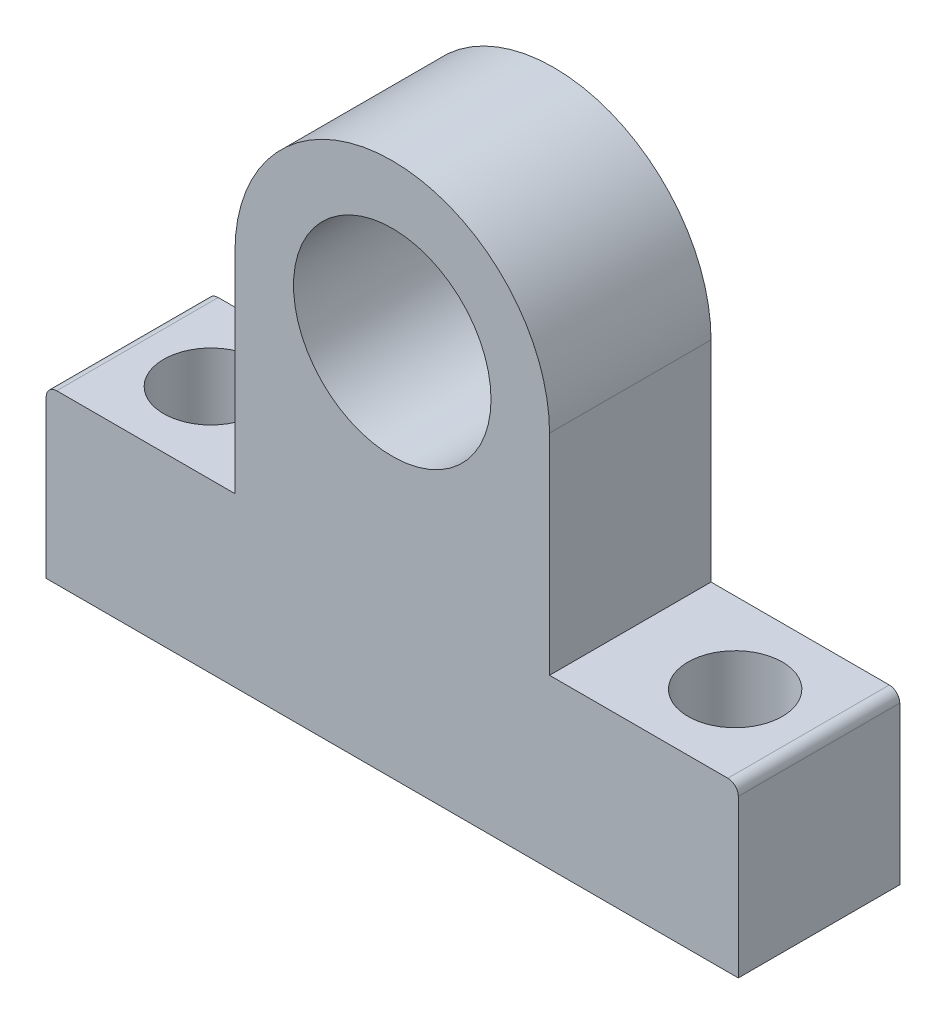
ISO-10303-21;
HEADER;
FILE_DESCRIPTION(('STEP AP214'),'2;1');
FILE_NAME('part.step','',(''),(''),'','','');
FILE_SCHEMA(('AUTOMOTIVE_DESIGN { 1 0 10303 214 1 1 1 1 }'));
ENDSEC;
DATA;
#1=APPLICATION_CONTEXT('core data for automotive mechanical design processes');
#2=APPLICATION_PROTOCOL_DEFINITION('international standard','automotive_design',2000,#1);
#3=PRODUCT_CONTEXT('',#1,'mechanical');
#4=PRODUCT('Part','Part','',(#3));
#5=PRODUCT_RELATED_PRODUCT_CATEGORY('part','',(#4));
#6=PRODUCT_DEFINITION_FORMATION('','',#4);
#7=PRODUCT_DEFINITION_CONTEXT('part definition',#1,'design');
#8=PRODUCT_DEFINITION('design','',#6,#7);
#9=PRODUCT_DEFINITION_SHAPE('','',#8);
#10=(LENGTH_UNIT() NAMED_UNIT(*) SI_UNIT(.MILLI.,.METRE.));
#11=(NAMED_UNIT(*) PLANE_ANGLE_UNIT() SI_UNIT($,.RADIAN.));
#12=(NAMED_UNIT(*) SI_UNIT($,.STERADIAN.) SOLID_ANGLE_UNIT());
#13=UNCERTAINTY_MEASURE_WITH_UNIT(LENGTH_MEASURE(1.E-05),#10,'distance_accuracy_value','');
#14=(GEOMETRIC_REPRESENTATION_CONTEXT(3) GLOBAL_UNCERTAINTY_ASSIGNED_CONTEXT((#13)) GLOBAL_UNIT_ASSIGNED_CONTEXT((#10,
#11,#12)) REPRESENTATION_CONTEXT('',''));
#15=CARTESIAN_POINT('',(0.,0.,0.));
#16=DIRECTION('',(0.,0.,1.));
#17=DIRECTION('',(1.,0.,0.));
#18=AXIS2_PLACEMENT_3D('',#15,#16,#17);
#19=CARTESIAN_POINT('',(-30.2675159235669,0.,15.4));
#20=DIRECTION('',(0.,1.,0.));
#21=DIRECTION('',(0.,0.,1.));
#22=AXIS2_PLACEMENT_3D('',#19,#20,#21);
#23=PLANE('',#22);
#24=CARTESIAN_POINT('',(27.7324840764331,0.,7.7));
#25=DIRECTION('',(0.,-1.,0.));
#26=DIRECTION('',(0.,0.,-1.));
#27=AXIS2_PLACEMENT_3D('',#24,#25,#26);
#28=CIRCLE('',#27,4.5);
#29=CARTESIAN_POINT('',(27.7324840764331,0.,3.2));
#30=VERTEX_POINT('',#29);
#31=EDGE_CURVE('E192',#30,#30,#28,.T.);
#32=ORIENTED_EDGE('',*,*,#31,.F.);
#33=EDGE_LOOP('',(#32));
#34=FACE_BOUND('',#33,.T.);
#35=CARTESIAN_POINT('',(-22.2675159235669,0.,7.7));
#36=DIRECTION('',(0.,-1.,0.));
#37=DIRECTION('',(0.,0.,-1.));
#38=AXIS2_PLACEMENT_3D('',#35,#36,#37);
#39=CIRCLE('',#38,4.5);
#40=CARTESIAN_POINT('',(-22.2675159235669,0.,3.2));
#41=VERTEX_POINT('',#40);
#42=EDGE_CURVE('E182',#41,#41,#39,.T.);
#43=ORIENTED_EDGE('',*,*,#42,.F.);
#44=EDGE_LOOP('',(#43));
#45=FACE_BOUND('',#44,.T.);
#46=DIRECTION('',(1.,0.,0.));
#47=VECTOR('',#46,1.);
#48=CARTESIAN_POINT('',(-30.2675159235669,0.,0.));
#49=LINE('',#48,#47);
#50=CARTESIAN_POINT('',(-30.2675159235669,0.,0.));
#51=VERTEX_POINT('',#50);
#52=CARTESIAN_POINT('',(35.7324840764331,0.,0.));
#53=VERTEX_POINT('',#52);
#54=EDGE_CURVE('E143',#51,#53,#49,.T.);
#55=ORIENTED_EDGE('',*,*,#54,.T.);
#56=DIRECTION('',(0.,0.,-1.));
#57=VECTOR('',#56,1.);
#58=CARTESIAN_POINT('',(35.7324840764331,0.,15.4));
#59=LINE('',#58,#57);
#60=CARTESIAN_POINT('',(35.7324840764331,0.,15.4));
#61=VERTEX_POINT('',#60);
#62=EDGE_CURVE('E11',#61,#53,#59,.T.);
#63=ORIENTED_EDGE('',*,*,#62,.F.);
#64=DIRECTION('',(1.,0.,0.));
#65=VECTOR('',#64,1.);
#66=CARTESIAN_POINT('',(-30.2675159235669,0.,15.4));
#67=LINE('',#66,#65);
#68=CARTESIAN_POINT('',(-30.2675159235669,0.,15.4));
#69=VERTEX_POINT('',#68);
#70=EDGE_CURVE('E162',#69,#61,#67,.T.);
#71=ORIENTED_EDGE('',*,*,#70,.F.);
#72=DIRECTION('',(0.,0.,-1.));
#73=VECTOR('',#72,1.);
#74=CARTESIAN_POINT('',(-30.2675159235669,0.,15.4));
#75=LINE('',#74,#73);
#76=EDGE_CURVE('E139',#69,#51,#75,.T.);
#77=ORIENTED_EDGE('',*,*,#76,.T.);
#78=EDGE_LOOP('',(#55,#63,#71,#77));
#79=FACE_BOUND('',#78,.T.);
#80=ADVANCED_FACE('F33',(#34,#45,#79),#23,.F.);
#81=CARTESIAN_POINT('',(35.7324840764331,15.,15.4));
#82=DIRECTION('',(-1.,0.,0.));
#83=DIRECTION('',(0.,0.,1.));
#84=AXIS2_PLACEMENT_3D('',#81,#82,#83);
#85=PLANE('',#84);
#86=DIRECTION('',(0.,1.,0.));
#87=VECTOR('',#86,1.);
#88=CARTESIAN_POINT('',(35.7324840764331,15.,0.));
#89=LINE('',#88,#87);
#90=CARTESIAN_POINT('',(35.7324840764331,15.,0.));
#91=VERTEX_POINT('',#90);
#92=EDGE_CURVE('E146',#53,#91,#89,.T.);
#93=ORIENTED_EDGE('',*,*,#92,.T.);
#94=DIRECTION('',(0.,0.,-1.));
#95=VECTOR('',#94,1.);
#96=CARTESIAN_POINT('',(35.7324840764331,15.,15.4));
#97=LINE('',#96,#95);
#98=CARTESIAN_POINT('',(35.7324840764331,15.,15.4));
#99=VERTEX_POINT('',#98);
#100=EDGE_CURVE('E42',#99,#91,#97,.T.);
#101=ORIENTED_EDGE('',*,*,#100,.F.);
#102=DIRECTION('',(0.,1.,0.));
#103=VECTOR('',#102,1.);
#104=CARTESIAN_POINT('',(35.7324840764331,15.,15.4));
#105=LINE('',#104,#103);
#106=EDGE_CURVE('E100',#61,#99,#105,.T.);
#107=ORIENTED_EDGE('',*,*,#106,.F.);
#108=ORIENTED_EDGE('',*,*,#62,.T.);
#109=EDGE_LOOP('',(#93,#101,#107,#108));
#110=FACE_BOUND('',#109,.T.);
#111=ADVANCED_FACE('F235',(#110),#85,.F.);
#112=CARTESIAN_POINT('',(34.7324840764331,15.,15.4));
#113=DIRECTION('',(0.,0.,-1.));
#114=DIRECTION('',(-1.,0.,0.));
#115=AXIS2_PLACEMENT_3D('',#112,#113,#114);
#116=CYLINDRICAL_SURFACE('',#115,1.);
#117=CARTESIAN_POINT('',(34.7324840764331,15.,0.));
#118=DIRECTION('',(0.,0.,1.));
#119=DIRECTION('',(-1.,0.,0.));
#120=AXIS2_PLACEMENT_3D('',#117,#118,#119);
#121=CIRCLE('',#120,1.);
#122=CARTESIAN_POINT('',(34.7324840764331,16.,0.));
#123=VERTEX_POINT('',#122);
#124=EDGE_CURVE('E149',#91,#123,#121,.T.);
#125=ORIENTED_EDGE('',*,*,#124,.T.);
#126=DIRECTION('',(0.,0.,-1.));
#127=VECTOR('',#126,1.);
#128=CARTESIAN_POINT('',(34.7324840764331,16.,15.4));
#129=LINE('',#128,#127);
#130=CARTESIAN_POINT('',(34.7324840764331,16.,15.4));
#131=VERTEX_POINT('',#130);
#132=EDGE_CURVE('E175',#131,#123,#129,.T.);
#133=ORIENTED_EDGE('',*,*,#132,.F.);
#134=CARTESIAN_POINT('',(34.7324840764331,15.,15.4));
#135=DIRECTION('',(0.,0.,1.));
#136=DIRECTION('',(-1.,0.,0.));
#137=AXIS2_PLACEMENT_3D('',#134,#135,#136);
#138=CIRCLE('',#137,1.);
#139=EDGE_CURVE('E199',#99,#131,#138,.T.);
#140=ORIENTED_EDGE('',*,*,#139,.F.);
#141=ORIENTED_EDGE('',*,*,#100,.T.);
#142=EDGE_LOOP('',(#125,#133,#140,#141));
#143=FACE_BOUND('',#142,.T.);
#144=ADVANCED_FACE('F240',(#143),#116,.T.);
#145=CARTESIAN_POINT('',(17.7324840764331,16.,15.4));
#146=DIRECTION('',(0.,-1.,0.));
#147=DIRECTION('',(0.,0.,-1.));
#148=AXIS2_PLACEMENT_3D('',#145,#146,#147);
#149=PLANE('',#148);
#150=CARTESIAN_POINT('',(27.7324840764331,16.,7.7));
#151=DIRECTION('',(0.,-1.,0.));
#152=DIRECTION('',(0.,0.,-1.));
#153=AXIS2_PLACEMENT_3D('',#150,#151,#152);
#154=CIRCLE('',#153,4.5);
#155=CARTESIAN_POINT('',(27.7324840764331,16.,3.2));
#156=VERTEX_POINT('',#155);
#157=EDGE_CURVE('E36',#156,#156,#154,.T.);
#158=ORIENTED_EDGE('',*,*,#157,.T.);
#159=EDGE_LOOP('',(#158));
#160=FACE_BOUND('',#159,.T.);
#161=DIRECTION('',(-1.,0.,0.));
#162=VECTOR('',#161,1.);
#163=CARTESIAN_POINT('',(17.7324840764331,16.,0.));
#164=LINE('',#163,#162);
#165=CARTESIAN_POINT('',(17.7324840764331,16.,0.));
#166=VERTEX_POINT('',#165);
#167=EDGE_CURVE('E151',#123,#166,#164,.T.);
#168=ORIENTED_EDGE('',*,*,#167,.T.);
#169=DIRECTION('',(0.,0.,-1.));
#170=VECTOR('',#169,1.);
#171=CARTESIAN_POINT('',(17.7324840764331,16.,15.4));
#172=LINE('',#171,#170);
#173=CARTESIAN_POINT('',(17.7324840764331,16.,15.4));
#174=VERTEX_POINT('',#173);
#175=EDGE_CURVE('E172',#174,#166,#172,.T.);
#176=ORIENTED_EDGE('',*,*,#175,.F.);
#177=DIRECTION('',(-1.,0.,0.));
#178=VECTOR('',#177,1.);
#179=CARTESIAN_POINT('',(17.7324840764331,16.,15.4));
#180=LINE('',#179,#178);
#181=EDGE_CURVE('E201',#131,#174,#180,.T.);
#182=ORIENTED_EDGE('',*,*,#181,.F.);
#183=ORIENTED_EDGE('',*,*,#132,.T.);
#184=EDGE_LOOP('',(#168,#176,#182,#183));
#185=FACE_BOUND('',#184,.T.);
#186=ADVANCED_FACE('F252',(#160,#185),#149,.F.);
#187=CARTESIAN_POINT('',(17.7324840764331,36.,15.4));
#188=DIRECTION('',(-1.,0.,0.));
#189=DIRECTION('',(0.,-1.,0.));
#190=AXIS2_PLACEMENT_3D('',#187,#188,#189);
#191=PLANE('',#190);
#192=DIRECTION('',(0.,1.,0.));
#193=VECTOR('',#192,1.);
#194=CARTESIAN_POINT('',(17.7324840764331,36.,0.));
#195=LINE('',#194,#193);
#196=CARTESIAN_POINT('',(17.7324840764331,36.,0.));
#197=VERTEX_POINT('',#196);
#198=EDGE_CURVE('E153',#166,#197,#195,.T.);
#199=ORIENTED_EDGE('',*,*,#198,.T.);
#200=DIRECTION('',(0.,0.,-1.));
#201=VECTOR('',#200,1.);
#202=CARTESIAN_POINT('',(17.7324840764331,36.,15.4));
#203=LINE('',#202,#201);
#204=CARTESIAN_POINT('',(17.7324840764331,36.,15.4));
#205=VERTEX_POINT('',#204);
#206=EDGE_CURVE('E169',#205,#197,#203,.T.);
#207=ORIENTED_EDGE('',*,*,#206,.F.);
#208=DIRECTION('',(0.,1.,0.));
#209=VECTOR('',#208,1.);
#210=CARTESIAN_POINT('',(17.7324840764331,36.,15.4));
#211=LINE('',#210,#209);
#212=EDGE_CURVE('E203',#174,#205,#211,.T.);
#213=ORIENTED_EDGE('',*,*,#212,.F.);
#214=ORIENTED_EDGE('',*,*,#175,.T.);
#215=EDGE_LOOP('',(#199,#207,#213,#214));
#216=FACE_BOUND('',#215,.T.);
#217=ADVANCED_FACE('F255',(#216),#191,.F.);
#218=CARTESIAN_POINT('',(2.73248407643312,36.,15.4));
#219=DIRECTION('',(0.,0.,-1.));
#220=DIRECTION('',(-1.,0.,0.));
#221=AXIS2_PLACEMENT_3D('',#218,#219,#220);
#222=CYLINDRICAL_SURFACE('',#221,15.);
#223=CARTESIAN_POINT('',(2.73248407643312,36.,0.));
#224=DIRECTION('',(0.,0.,1.));
#225=DIRECTION('',(1.,0.,0.));
#226=AXIS2_PLACEMENT_3D('',#223,#224,#225);
#227=CIRCLE('',#226,15.);
#228=CARTESIAN_POINT('',(-12.2675159235669,36.,0.));
#229=VERTEX_POINT('',#228);
#230=EDGE_CURVE('E155',#197,#229,#227,.T.);
#231=ORIENTED_EDGE('',*,*,#230,.T.);
#232=DIRECTION('',(0.,0.,-1.));
#233=VECTOR('',#232,1.);
#234=CARTESIAN_POINT('',(-12.2675159235669,36.,15.4));
#235=LINE('',#234,#233);
#236=CARTESIAN_POINT('',(-12.2675159235669,36.,15.4));
#237=VERTEX_POINT('',#236);
#238=EDGE_CURVE('E166',#237,#229,#235,.T.);
#239=ORIENTED_EDGE('',*,*,#238,.F.);
#240=CARTESIAN_POINT('',(2.73248407643312,36.,15.4));
#241=DIRECTION('',(0.,0.,1.));
#242=DIRECTION('',(1.,0.,0.));
#243=AXIS2_PLACEMENT_3D('',#240,#241,#242);
#244=CIRCLE('',#243,15.);
#245=EDGE_CURVE('E205',#205,#237,#244,.T.);
#246=ORIENTED_EDGE('',*,*,#245,.F.);
#247=ORIENTED_EDGE('',*,*,#206,.T.);
#248=EDGE_LOOP('',(#231,#239,#246,#247));
#249=FACE_BOUND('',#248,.T.);
#250=ADVANCED_FACE('F211',(#249),#222,.T.);
#251=CARTESIAN_POINT('',(-12.2675159235669,16.,15.4));
#252=DIRECTION('',(1.,0.,0.));
#253=DIRECTION('',(0.,0.,-1.));
#254=AXIS2_PLACEMENT_3D('',#251,#252,#253);
#255=PLANE('',#254);
#256=DIRECTION('',(0.,-1.,0.));
#257=VECTOR('',#256,1.);
#258=CARTESIAN_POINT('',(-12.2675159235669,16.,0.));
#259=LINE('',#258,#257);
#260=CARTESIAN_POINT('',(-12.2675159235669,16.,0.));
#261=VERTEX_POINT('',#260);
#262=EDGE_CURVE('E157',#229,#261,#259,.T.);
#263=ORIENTED_EDGE('',*,*,#262,.T.);
#264=DIRECTION('',(0.,0.,-1.));
#265=VECTOR('',#264,1.);
#266=CARTESIAN_POINT('',(-12.2675159235669,16.,15.4));
#267=LINE('',#266,#265);
#268=CARTESIAN_POINT('',(-12.2675159235669,16.,15.4));
#269=VERTEX_POINT('',#268);
#270=EDGE_CURVE('E134',#269,#261,#267,.T.);
#271=ORIENTED_EDGE('',*,*,#270,.F.);
#272=DIRECTION('',(0.,-1.,0.));
#273=VECTOR('',#272,1.);
#274=CARTESIAN_POINT('',(-12.2675159235669,16.,15.4));
#275=LINE('',#274,#273);
#276=EDGE_CURVE('E125',#237,#269,#275,.T.);
#277=ORIENTED_EDGE('',*,*,#276,.F.);
#278=ORIENTED_EDGE('',*,*,#238,.T.);
#279=EDGE_LOOP('',(#263,#271,#277,#278));
#280=FACE_BOUND('',#279,.T.);
#281=ADVANCED_FACE('F215',(#280),#255,.F.);
#282=CARTESIAN_POINT('',(-29.2675159235669,16.,15.4));
#283=DIRECTION('',(0.,-1.,0.));
#284=DIRECTION('',(0.,0.,-1.));
#285=AXIS2_PLACEMENT_3D('',#282,#283,#284);
#286=PLANE('',#285);
#287=CARTESIAN_POINT('',(-22.2675159235669,16.,7.7));
#288=DIRECTION('',(0.,-1.,0.));
#289=DIRECTION('',(0.,0.,-1.));
#290=AXIS2_PLACEMENT_3D('',#287,#288,#289);
#291=CIRCLE('',#290,4.5);
#292=CARTESIAN_POINT('',(-22.2675159235669,16.,3.2));
#293=VERTEX_POINT('',#292);
#294=EDGE_CURVE('E179',#293,#293,#291,.T.);
#295=ORIENTED_EDGE('',*,*,#294,.T.);
#296=EDGE_LOOP('',(#295));
#297=FACE_BOUND('',#296,.T.);
#298=DIRECTION('',(-1.,0.,0.));
#299=VECTOR('',#298,1.);
#300=CARTESIAN_POINT('',(-29.2675159235669,16.,0.));
#301=LINE('',#300,#299);
#302=CARTESIAN_POINT('',(-29.2675159235669,16.,0.));
#303=VERTEX_POINT('',#302);
#304=EDGE_CURVE('E133',#261,#303,#301,.T.);
#305=ORIENTED_EDGE('',*,*,#304,.T.);
#306=DIRECTION('',(0.,0.,-1.));
#307=VECTOR('',#306,1.);
#308=CARTESIAN_POINT('',(-29.2675159235669,16.,15.4));
#309=LINE('',#308,#307);
#310=CARTESIAN_POINT('',(-29.2675159235669,16.,15.4));
#311=VERTEX_POINT('',#310);
#312=EDGE_CURVE('E130',#311,#303,#309,.T.);
#313=ORIENTED_EDGE('',*,*,#312,.F.);
#314=DIRECTION('',(-1.,0.,0.));
#315=VECTOR('',#314,1.);
#316=CARTESIAN_POINT('',(-29.2675159235669,16.,15.4));
#317=LINE('',#316,#315);
#318=EDGE_CURVE('E119',#269,#311,#317,.T.);
#319=ORIENTED_EDGE('',*,*,#318,.F.);
#320=ORIENTED_EDGE('',*,*,#270,.T.);
#321=EDGE_LOOP('',(#305,#313,#319,#320));
#322=FACE_BOUND('',#321,.T.);
#323=ADVANCED_FACE('F131',(#297,#322),#286,.F.);
#324=CARTESIAN_POINT('',(-29.2675159235669,15.,15.4));
#325=DIRECTION('',(0.,0.,-1.));
#326=DIRECTION('',(-1.,0.,0.));
#327=AXIS2_PLACEMENT_3D('',#324,#325,#326);
#328=CYLINDRICAL_SURFACE('',#327,1.);
#329=CARTESIAN_POINT('',(-29.2675159235669,15.,0.));
#330=DIRECTION('',(0.,0.,1.));
#331=DIRECTION('',(-1.,0.,0.));
#332=AXIS2_PLACEMENT_3D('',#329,#330,#331);
#333=CIRCLE('',#332,1.);
#334=CARTESIAN_POINT('',(-30.2675159235669,15.,0.));
#335=VERTEX_POINT('',#334);
#336=EDGE_CURVE('E86',#303,#335,#333,.T.);
#337=ORIENTED_EDGE('',*,*,#336,.T.);
#338=DIRECTION('',(0.,0.,-1.));
#339=VECTOR('',#338,1.);
#340=CARTESIAN_POINT('',(-30.2675159235669,15.,15.4));
#341=LINE('',#340,#339);
#342=CARTESIAN_POINT('',(-30.2675159235669,15.,15.4));
#343=VERTEX_POINT('',#342);
#344=EDGE_CURVE('E135',#343,#335,#341,.T.);
#345=ORIENTED_EDGE('',*,*,#344,.F.);
#346=CARTESIAN_POINT('',(-29.2675159235669,15.,15.4));
#347=DIRECTION('',(0.,0.,1.));
#348=DIRECTION('',(-1.,0.,0.));
#349=AXIS2_PLACEMENT_3D('',#346,#347,#348);
#350=CIRCLE('',#349,1.);
#351=EDGE_CURVE('E123',#311,#343,#350,.T.);
#352=ORIENTED_EDGE('',*,*,#351,.F.);
#353=ORIENTED_EDGE('',*,*,#312,.T.);
#354=EDGE_LOOP('',(#337,#345,#352,#353));
#355=FACE_BOUND('',#354,.T.);
#356=ADVANCED_FACE('F137',(#355),#328,.T.);
#357=CARTESIAN_POINT('',(-30.2675159235669,0.,15.4));
#358=DIRECTION('',(1.,0.,0.));
#359=DIRECTION('',(0.,0.,-1.));
#360=AXIS2_PLACEMENT_3D('',#357,#358,#359);
#361=PLANE('',#360);
#362=DIRECTION('',(0.,-1.,0.));
#363=VECTOR('',#362,1.);
#364=CARTESIAN_POINT('',(-30.2675159235669,0.,0.));
#365=LINE('',#364,#363);
#366=EDGE_CURVE('E92',#335,#51,#365,.T.);
#367=ORIENTED_EDGE('',*,*,#366,.T.);
#368=ORIENTED_EDGE('',*,*,#76,.F.);
#369=DIRECTION('',(0.,-1.,0.));
#370=VECTOR('',#369,1.);
#371=CARTESIAN_POINT('',(-30.2675159235669,0.,15.4));
#372=LINE('',#371,#370);
#373=EDGE_CURVE('E51',#343,#69,#372,.T.);
#374=ORIENTED_EDGE('',*,*,#373,.F.);
#375=ORIENTED_EDGE('',*,*,#344,.T.);
#376=EDGE_LOOP('',(#367,#368,#374,#375));
#377=FACE_BOUND('',#376,.T.);
#378=ADVANCED_FACE('F223',(#377),#361,.F.);
#379=CARTESIAN_POINT('',(34.7324840764331,15.,15.4));
#380=DIRECTION('',(0.,0.,-1.));
#381=DIRECTION('',(-1.,0.,0.));
#382=AXIS2_PLACEMENT_3D('',#379,#380,#381);
#383=PLANE('',#382);
#384=CARTESIAN_POINT('',(2.73248407643312,36.,15.4));
#385=DIRECTION('',(0.,0.,1.));
#386=DIRECTION('',(1.,0.,0.));
#387=AXIS2_PLACEMENT_3D('',#384,#385,#386);
#388=CIRCLE('',#387,9.41786640130221);
#389=CARTESIAN_POINT('',(12.1503504777353,36.,15.4));
#390=VERTEX_POINT('',#389);
#391=EDGE_CURVE('E181',#390,#390,#388,.T.);
#392=ORIENTED_EDGE('',*,*,#391,.F.);
#393=EDGE_LOOP('',(#392));
#394=FACE_BOUND('',#393,.T.);
#395=ORIENTED_EDGE('',*,*,#70,.T.);
#396=ORIENTED_EDGE('',*,*,#106,.T.);
#397=ORIENTED_EDGE('',*,*,#139,.T.);
#398=ORIENTED_EDGE('',*,*,#181,.T.);
#399=ORIENTED_EDGE('',*,*,#212,.T.);
#400=ORIENTED_EDGE('',*,*,#245,.T.);
#401=ORIENTED_EDGE('',*,*,#276,.T.);
#402=ORIENTED_EDGE('',*,*,#318,.T.);
#403=ORIENTED_EDGE('',*,*,#351,.T.);
#404=ORIENTED_EDGE('',*,*,#373,.T.);
#405=EDGE_LOOP('',(#395,#396,#397,#398,#399,#400,#401,#402,#403,#404));
#406=FACE_BOUND('',#405,.T.);
#407=ADVANCED_FACE('F121',(#394,#406),#383,.F.);
#408=CARTESIAN_POINT('',(34.7324840764331,15.,0.));
#409=DIRECTION('',(0.,0.,-1.));
#410=DIRECTION('',(-1.,0.,0.));
#411=AXIS2_PLACEMENT_3D('',#408,#409,#410);
#412=PLANE('',#411);
#413=CARTESIAN_POINT('',(2.73248407643312,36.,0.));
#414=DIRECTION('',(0.,0.,1.));
#415=DIRECTION('',(1.,0.,0.));
#416=AXIS2_PLACEMENT_3D('',#413,#414,#415);
#417=CIRCLE('',#416,9.41786640130221);
#418=CARTESIAN_POINT('',(12.1503504777353,36.,0.));
#419=VERTEX_POINT('',#418);
#420=EDGE_CURVE('E147',#419,#419,#417,.T.);
#421=ORIENTED_EDGE('',*,*,#420,.T.);
#422=EDGE_LOOP('',(#421));
#423=FACE_BOUND('',#422,.T.);
#424=ORIENTED_EDGE('',*,*,#54,.F.);
#425=ORIENTED_EDGE('',*,*,#366,.F.);
#426=ORIENTED_EDGE('',*,*,#336,.F.);
#427=ORIENTED_EDGE('',*,*,#304,.F.);
#428=ORIENTED_EDGE('',*,*,#262,.F.);
#429=ORIENTED_EDGE('',*,*,#230,.F.);
#430=ORIENTED_EDGE('',*,*,#198,.F.);
#431=ORIENTED_EDGE('',*,*,#167,.F.);
#432=ORIENTED_EDGE('',*,*,#124,.F.);
#433=ORIENTED_EDGE('',*,*,#92,.F.);
#434=EDGE_LOOP('',(#424,#425,#426,#427,#428,#429,#430,#431,#432,#433));
#435=FACE_BOUND('',#434,.T.);
#436=ADVANCED_FACE('F218',(#423,#435),#412,.T.);
#437=CARTESIAN_POINT('',(2.73248407643312,36.,0.));
#438=DIRECTION('',(0.,0.,1.));
#439=DIRECTION('',(1.,0.,0.));
#440=AXIS2_PLACEMENT_3D('',#437,#438,#439);
#441=CYLINDRICAL_SURFACE('',#440,9.41786640130221);
#442=ORIENTED_EDGE('',*,*,#420,.F.);
#443=EDGE_LOOP('',(#442));
#444=FACE_BOUND('',#443,.T.);
#445=ORIENTED_EDGE('',*,*,#391,.T.);
#446=EDGE_LOOP('',(#445));
#447=FACE_BOUND('',#446,.T.);
#448=ADVANCED_FACE('F306',(#444,#447),#441,.F.);
#449=CARTESIAN_POINT('',(-22.2675159235669,51.,7.7));
#450=DIRECTION('',(0.,-1.,0.));
#451=DIRECTION('',(0.,0.,-1.));
#452=AXIS2_PLACEMENT_3D('',#449,#450,#451);
#453=CYLINDRICAL_SURFACE('',#452,4.5);
#454=ORIENTED_EDGE('',*,*,#42,.T.);
#455=EDGE_LOOP('',(#454));
#456=FACE_BOUND('',#455,.T.);
#457=ORIENTED_EDGE('',*,*,#294,.F.);
#458=EDGE_LOOP('',(#457));
#459=FACE_BOUND('',#458,.T.);
#460=ADVANCED_FACE('F248',(#456,#459),#453,.F.);
#461=CARTESIAN_POINT('',(27.7324840764331,51.,7.7));
#462=DIRECTION('',(0.,-1.,0.));
#463=DIRECTION('',(0.,0.,-1.));
#464=AXIS2_PLACEMENT_3D('',#461,#462,#463);
#465=CYLINDRICAL_SURFACE('',#464,4.5);
#466=ORIENTED_EDGE('',*,*,#31,.T.);
#467=EDGE_LOOP('',(#466));
#468=FACE_BOUND('',#467,.T.);
#469=ORIENTED_EDGE('',*,*,#157,.F.);
#470=EDGE_LOOP('',(#469));
#471=FACE_BOUND('',#470,.T.);
#472=ADVANCED_FACE('F245',(#468,#471),#465,.F.);
#473=CLOSED_SHELL('',(#80,#111,#144,#186,#217,#250,#281,#323,#356,#378,#407,#436,#448,#460,#472));
#474=MANIFOLD_SOLID_BREP('B2',#473);
#475=ADVANCED_BREP_SHAPE_REPRESENTATION('',(#18,#474),#14);
#476=SHAPE_DEFINITION_REPRESENTATION(#9,#475);
ENDSEC;
END-ISO-10303-21;
